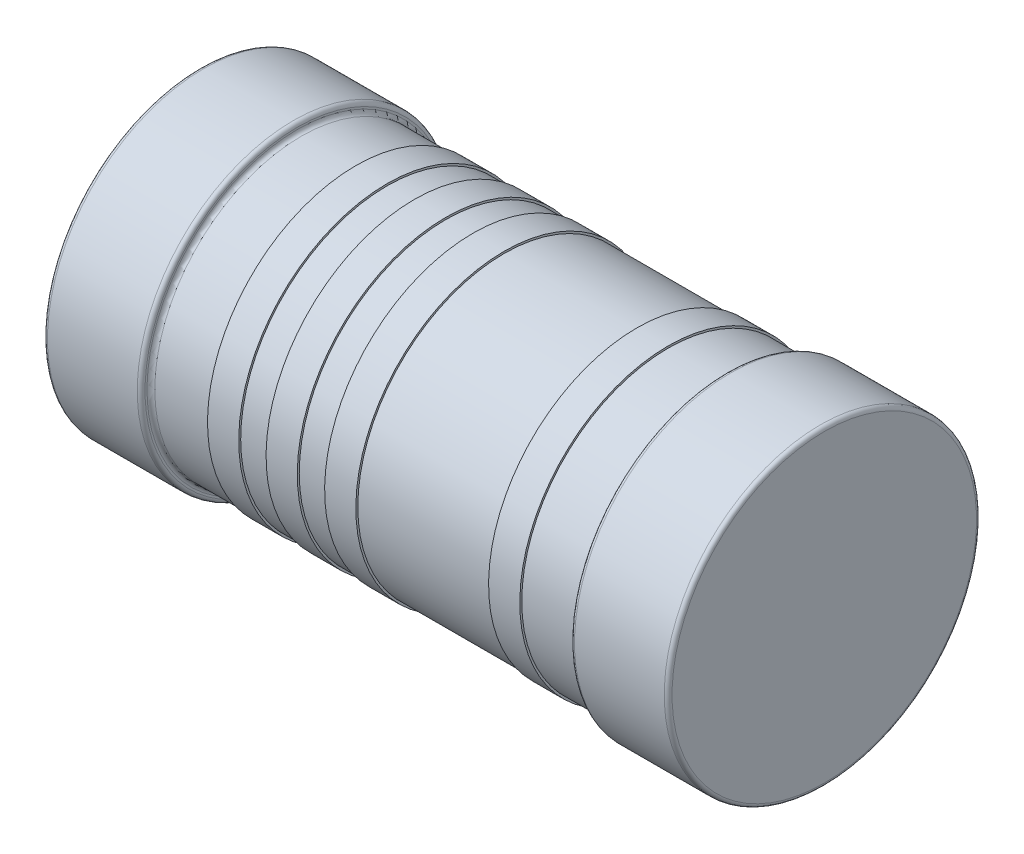
ISO-10303-21;
HEADER;
FILE_DESCRIPTION(('STEP AP214'),'2;1');
FILE_NAME('part.step','',(''),(''),'','','');
FILE_SCHEMA(('AUTOMOTIVE_DESIGN { 1 0 10303 214 1 1 1 1 }'));
ENDSEC;
DATA;
#1=APPLICATION_CONTEXT('core data for automotive mechanical design processes');
#2=APPLICATION_PROTOCOL_DEFINITION('international standard','automotive_design',2000,#1);
#3=PRODUCT_CONTEXT('',#1,'mechanical');
#4=PRODUCT('Part','Part','',(#3));
#5=PRODUCT_RELATED_PRODUCT_CATEGORY('part','',(#4));
#6=PRODUCT_DEFINITION_FORMATION('','',#4);
#7=PRODUCT_DEFINITION_CONTEXT('part definition',#1,'design');
#8=PRODUCT_DEFINITION('design','',#6,#7);
#9=PRODUCT_DEFINITION_SHAPE('','',#8);
#10=(LENGTH_UNIT() NAMED_UNIT(*) SI_UNIT(.MILLI.,.METRE.));
#11=(NAMED_UNIT(*) PLANE_ANGLE_UNIT() SI_UNIT($,.RADIAN.));
#12=(NAMED_UNIT(*) SI_UNIT($,.STERADIAN.) SOLID_ANGLE_UNIT());
#13=UNCERTAINTY_MEASURE_WITH_UNIT(LENGTH_MEASURE(1.E-05),#10,'distance_accuracy_value','');
#14=(GEOMETRIC_REPRESENTATION_CONTEXT(3) GLOBAL_UNCERTAINTY_ASSIGNED_CONTEXT((#13)) GLOBAL_UNIT_ASSIGNED_CONTEXT((#10,
#11,#12)) REPRESENTATION_CONTEXT('',''));
#15=CARTESIAN_POINT('',(0.,0.,0.));
#16=DIRECTION('',(0.,0.,1.));
#17=DIRECTION('',(1.,0.,0.));
#18=AXIS2_PLACEMENT_3D('',#15,#16,#17);
#19=CARTESIAN_POINT('',(-1.6,0.02,0.));
#20=DIRECTION('',(1.,0.,0.));
#21=DIRECTION('',(0.,1.,0.));
#22=AXIS2_PLACEMENT_3D('',#19,#20,#21);
#23=PLANE('',#22);
#24=CARTESIAN_POINT('',(-1.6,0.8,0.));
#25=DIRECTION('',(1.,0.,0.));
#26=DIRECTION('',(0.,1.,0.));
#27=AXIS2_PLACEMENT_3D('',#24,#25,#26);
#28=CIRCLE('',#27,0.78);
#29=CARTESIAN_POINT('',(-1.6,1.58,0.));
#30=VERTEX_POINT('',#29);
#31=EDGE_CURVE('E121',#30,#30,#28,.T.);
#32=ORIENTED_EDGE('',*,*,#31,.F.);
#33=EDGE_LOOP('',(#32));
#34=FACE_BOUND('',#33,.T.);
#35=ADVANCED_FACE('F33',(#34),#23,.F.);
#36=CARTESIAN_POINT('',(1.6,0.8,0.));
#37=DIRECTION('',(-1.,0.,0.));
#38=DIRECTION('',(0.,-1.,0.));
#39=AXIS2_PLACEMENT_3D('',#36,#37,#38);
#40=PLANE('',#39);
#41=CARTESIAN_POINT('',(1.6,0.8,0.));
#42=DIRECTION('',(1.,0.,0.));
#43=DIRECTION('',(0.,1.,0.));
#44=AXIS2_PLACEMENT_3D('',#41,#42,#43);
#45=CIRCLE('',#44,0.780000000000001);
#46=CARTESIAN_POINT('',(1.6,1.58,0.));
#47=VERTEX_POINT('',#46);
#48=EDGE_CURVE('E10',#47,#47,#45,.T.);
#49=ORIENTED_EDGE('',*,*,#48,.T.);
#50=EDGE_LOOP('',(#49));
#51=FACE_BOUND('',#50,.T.);
#52=ADVANCED_FACE('F128',(#51),#40,.F.);
#53=CARTESIAN_POINT('',(1.58,0.800000000000001,0.));
#54=DIRECTION('',(1.,0.,0.));
#55=DIRECTION('',(0.,1.,0.));
#56=AXIS2_PLACEMENT_3D('',#53,#54,#55);
#57=TOROIDAL_SURFACE('',#56,0.780000000000001,0.0200000000000002);
#58=ORIENTED_EDGE('',*,*,#48,.F.);
#59=EDGE_LOOP('',(#58));
#60=FACE_BOUND('',#59,.T.);
#61=CARTESIAN_POINT('',(1.58,0.8,0.));
#62=DIRECTION('',(1.,0.,0.));
#63=DIRECTION('',(0.,1.,0.));
#64=AXIS2_PLACEMENT_3D('',#61,#62,#63);
#65=CIRCLE('',#64,0.800000000000001);
#66=CARTESIAN_POINT('',(1.58,1.6,0.));
#67=VERTEX_POINT('',#66);
#68=EDGE_CURVE('E39',#67,#67,#65,.T.);
#69=ORIENTED_EDGE('',*,*,#68,.T.);
#70=EDGE_LOOP('',(#69));
#71=FACE_BOUND('',#70,.T.);
#72=ADVANCED_FACE('F132',(#60,#71),#57,.T.);
#73=CARTESIAN_POINT('',(-1.6,0.8,0.));
#74=DIRECTION('',(1.,0.,0.));
#75=DIRECTION('',(0.,1.,0.));
#76=AXIS2_PLACEMENT_3D('',#73,#74,#75);
#77=CYLINDRICAL_SURFACE('',#76,0.800000000000001);
#78=ORIENTED_EDGE('',*,*,#68,.F.);
#79=EDGE_LOOP('',(#78));
#80=FACE_BOUND('',#79,.T.);
#81=CARTESIAN_POINT('',(1.12,0.8,0.));
#82=DIRECTION('',(1.,0.,0.));
#83=DIRECTION('',(0.,1.,0.));
#84=AXIS2_PLACEMENT_3D('',#81,#82,#83);
#85=CIRCLE('',#84,0.8);
#86=CARTESIAN_POINT('',(1.12,1.6,0.));
#87=VERTEX_POINT('',#86);
#88=EDGE_CURVE('E43',#87,#87,#85,.T.);
#89=ORIENTED_EDGE('',*,*,#88,.T.);
#90=EDGE_LOOP('',(#89));
#91=FACE_BOUND('',#90,.T.);
#92=ADVANCED_FACE('F136',(#80,#91),#77,.T.);
#93=CARTESIAN_POINT('',(1.12,0.8,0.));
#94=DIRECTION('',(1.,0.,0.));
#95=DIRECTION('',(0.,1.,0.));
#96=AXIS2_PLACEMENT_3D('',#93,#94,#95);
#97=TOROIDAL_SURFACE('',#96,0.78,0.0200000000000001);
#98=ORIENTED_EDGE('',*,*,#88,.F.);
#99=EDGE_LOOP('',(#98));
#100=FACE_BOUND('',#99,.T.);
#101=CARTESIAN_POINT('',(1.1,0.8,0.));
#102=DIRECTION('',(1.,0.,0.));
#103=DIRECTION('',(0.,1.,0.));
#104=AXIS2_PLACEMENT_3D('',#101,#102,#103);
#105=CIRCLE('',#104,0.78);
#106=CARTESIAN_POINT('',(1.1,1.58,0.));
#107=VERTEX_POINT('',#106);
#108=EDGE_CURVE('E47',#107,#107,#105,.T.);
#109=ORIENTED_EDGE('',*,*,#108,.T.);
#110=EDGE_LOOP('',(#109));
#111=FACE_BOUND('',#110,.T.);
#112=ADVANCED_FACE('F142',(#100,#111),#97,.T.);
#113=CARTESIAN_POINT('',(1.1,0.03,0.));
#114=DIRECTION('',(1.,0.,0.));
#115=DIRECTION('',(0.,1.,0.));
#116=AXIS2_PLACEMENT_3D('',#113,#114,#115);
#117=PLANE('',#116);
#118=ORIENTED_EDGE('',*,*,#108,.F.);
#119=EDGE_LOOP('',(#118));
#120=FACE_BOUND('',#119,.T.);
#121=CARTESIAN_POINT('',(1.1,0.8,0.));
#122=DIRECTION('',(1.,0.,0.));
#123=DIRECTION('',(0.,1.,0.));
#124=AXIS2_PLACEMENT_3D('',#121,#122,#123);
#125=CIRCLE('',#124,0.77);
#126=CARTESIAN_POINT('',(1.1,1.57,0.));
#127=VERTEX_POINT('',#126);
#128=EDGE_CURVE('E52',#127,#127,#125,.T.);
#129=ORIENTED_EDGE('',*,*,#128,.T.);
#130=EDGE_LOOP('',(#129));
#131=FACE_BOUND('',#130,.T.);
#132=ADVANCED_FACE('F146',(#120,#131),#117,.F.);
#133=CARTESIAN_POINT('',(1.08,0.8,0.));
#134=DIRECTION('',(1.,0.,0.));
#135=DIRECTION('',(0.,1.,0.));
#136=AXIS2_PLACEMENT_3D('',#133,#134,#135);
#137=TOROIDAL_SURFACE('',#136,0.77,0.0199999999999999);
#138=ORIENTED_EDGE('',*,*,#128,.F.);
#139=EDGE_LOOP('',(#138));
#140=FACE_BOUND('',#139,.T.);
#141=CARTESIAN_POINT('',(1.08,0.8,0.));
#142=DIRECTION('',(1.,0.,0.));
#143=DIRECTION('',(0.,1.,0.));
#144=AXIS2_PLACEMENT_3D('',#141,#142,#143);
#145=CIRCLE('',#144,0.750000000000001);
#146=CARTESIAN_POINT('',(1.08,1.55,0.));
#147=VERTEX_POINT('',#146);
#148=EDGE_CURVE('E55',#147,#147,#145,.T.);
#149=ORIENTED_EDGE('',*,*,#148,.T.);
#150=EDGE_LOOP('',(#149));
#151=FACE_BOUND('',#150,.T.);
#152=ADVANCED_FACE('F150',(#140,#151),#137,.F.);
#153=CARTESIAN_POINT('',(-1.6,0.8,0.));
#154=DIRECTION('',(1.,0.,0.));
#155=DIRECTION('',(0.,1.,0.));
#156=AXIS2_PLACEMENT_3D('',#153,#154,#155);
#157=CYLINDRICAL_SURFACE('',#156,0.75);
#158=ORIENTED_EDGE('',*,*,#148,.F.);
#159=EDGE_LOOP('',(#158));
#160=FACE_BOUND('',#159,.T.);
#161=CARTESIAN_POINT('',(0.8,0.8,0.));
#162=DIRECTION('',(1.,0.,0.));
#163=DIRECTION('',(0.,1.,0.));
#164=AXIS2_PLACEMENT_3D('',#161,#162,#163);
#165=CIRCLE('',#164,0.75);
#166=CARTESIAN_POINT('',(0.8,1.55,0.));
#167=VERTEX_POINT('',#166);
#168=EDGE_CURVE('E58',#167,#167,#165,.T.);
#169=ORIENTED_EDGE('',*,*,#168,.T.);
#170=EDGE_LOOP('',(#169));
#171=FACE_BOUND('',#170,.T.);
#172=ADVANCED_FACE('F154',(#160,#171),#157,.T.);
#173=CARTESIAN_POINT('',(0.8,0.05,0.));
#174=DIRECTION('',(-1.,0.,0.));
#175=DIRECTION('',(0.,-1.,0.));
#176=AXIS2_PLACEMENT_3D('',#173,#174,#175);
#177=PLANE('',#176);
#178=ORIENTED_EDGE('',*,*,#168,.F.);
#179=EDGE_LOOP('',(#178));
#180=FACE_BOUND('',#179,.T.);
#181=CARTESIAN_POINT('',(0.8,0.8,0.));
#182=DIRECTION('',(1.,0.,0.));
#183=DIRECTION('',(0.,1.,0.));
#184=AXIS2_PLACEMENT_3D('',#181,#182,#183);
#185=CIRCLE('',#184,0.76);
#186=CARTESIAN_POINT('',(0.8,1.56,0.));
#187=VERTEX_POINT('',#186);
#188=EDGE_CURVE('E61',#187,#187,#185,.T.);
#189=ORIENTED_EDGE('',*,*,#188,.T.);
#190=EDGE_LOOP('',(#189));
#191=FACE_BOUND('',#190,.T.);
#192=ADVANCED_FACE('F158',(#180,#191),#177,.F.);
#193=CARTESIAN_POINT('',(-1.6,0.8,0.));
#194=DIRECTION('',(1.,0.,0.));
#195=DIRECTION('',(0.,1.,0.));
#196=AXIS2_PLACEMENT_3D('',#193,#194,#195);
#197=CYLINDRICAL_SURFACE('',#196,0.76);
#198=ORIENTED_EDGE('',*,*,#188,.F.);
#199=EDGE_LOOP('',(#198));
#200=FACE_BOUND('',#199,.T.);
#201=CARTESIAN_POINT('',(0.64,0.8,0.));
#202=DIRECTION('',(1.,0.,0.));
#203=DIRECTION('',(0.,1.,0.));
#204=AXIS2_PLACEMENT_3D('',#201,#202,#203);
#205=CIRCLE('',#204,0.76);
#206=CARTESIAN_POINT('',(0.64,1.56,0.));
#207=VERTEX_POINT('',#206);
#208=EDGE_CURVE('E64',#207,#207,#205,.T.);
#209=ORIENTED_EDGE('',*,*,#208,.T.);
#210=EDGE_LOOP('',(#209));
#211=FACE_BOUND('',#210,.T.);
#212=ADVANCED_FACE('F162',(#200,#211),#197,.T.);
#213=CARTESIAN_POINT('',(0.64,0.0400000000000001,0.));
#214=DIRECTION('',(1.,0.,0.));
#215=DIRECTION('',(0.,1.,0.));
#216=AXIS2_PLACEMENT_3D('',#213,#214,#215);
#217=PLANE('',#216);
#218=ORIENTED_EDGE('',*,*,#208,.F.);
#219=EDGE_LOOP('',(#218));
#220=FACE_BOUND('',#219,.T.);
#221=CARTESIAN_POINT('',(0.64,0.8,0.));
#222=DIRECTION('',(1.,0.,0.));
#223=DIRECTION('',(0.,1.,0.));
#224=AXIS2_PLACEMENT_3D('',#221,#222,#223);
#225=CIRCLE('',#224,0.75);
#226=CARTESIAN_POINT('',(0.64,1.55,0.));
#227=VERTEX_POINT('',#226);
#228=EDGE_CURVE('E67',#227,#227,#225,.T.);
#229=ORIENTED_EDGE('',*,*,#228,.T.);
#230=EDGE_LOOP('',(#229));
#231=FACE_BOUND('',#230,.T.);
#232=ADVANCED_FACE('F166',(#220,#231),#217,.F.);
#233=CARTESIAN_POINT('',(-1.6,0.8,0.));
#234=DIRECTION('',(1.,0.,0.));
#235=DIRECTION('',(0.,1.,0.));
#236=AXIS2_PLACEMENT_3D('',#233,#234,#235);
#237=CYLINDRICAL_SURFACE('',#236,0.75);
#238=ORIENTED_EDGE('',*,*,#228,.F.);
#239=EDGE_LOOP('',(#238));
#240=FACE_BOUND('',#239,.T.);
#241=CARTESIAN_POINT('',(-0.0400000000000003,0.8,0.));
#242=DIRECTION('',(1.,0.,0.));
#243=DIRECTION('',(0.,1.,0.));
#244=AXIS2_PLACEMENT_3D('',#241,#242,#243);
#245=CIRCLE('',#244,0.75);
#246=CARTESIAN_POINT('',(-0.0400000000000004,1.55,0.));
#247=VERTEX_POINT('',#246);
#248=EDGE_CURVE('E70',#247,#247,#245,.T.);
#249=ORIENTED_EDGE('',*,*,#248,.T.);
#250=EDGE_LOOP('',(#249));
#251=FACE_BOUND('',#250,.T.);
#252=ADVANCED_FACE('F170',(#240,#251),#237,.T.);
#253=CARTESIAN_POINT('',(-0.04,0.04,0.));
#254=DIRECTION('',(-1.,0.,0.));
#255=DIRECTION('',(0.,-1.,0.));
#256=AXIS2_PLACEMENT_3D('',#253,#254,#255);
#257=PLANE('',#256);
#258=ORIENTED_EDGE('',*,*,#248,.F.);
#259=EDGE_LOOP('',(#258));
#260=FACE_BOUND('',#259,.T.);
#261=CARTESIAN_POINT('',(-0.0400000000000001,0.8,0.));
#262=DIRECTION('',(1.,0.,0.));
#263=DIRECTION('',(0.,1.,0.));
#264=AXIS2_PLACEMENT_3D('',#261,#262,#263);
#265=CIRCLE('',#264,0.76);
#266=CARTESIAN_POINT('',(-0.0400000000000002,1.56,0.));
#267=VERTEX_POINT('',#266);
#268=EDGE_CURVE('E73',#267,#267,#265,.T.);
#269=ORIENTED_EDGE('',*,*,#268,.T.);
#270=EDGE_LOOP('',(#269));
#271=FACE_BOUND('',#270,.T.);
#272=ADVANCED_FACE('F174',(#260,#271),#257,.F.);
#273=CARTESIAN_POINT('',(-1.6,0.8,0.));
#274=DIRECTION('',(1.,0.,0.));
#275=DIRECTION('',(0.,1.,0.));
#276=AXIS2_PLACEMENT_3D('',#273,#274,#275);
#277=CYLINDRICAL_SURFACE('',#276,0.76);
#278=ORIENTED_EDGE('',*,*,#268,.F.);
#279=EDGE_LOOP('',(#278));
#280=FACE_BOUND('',#279,.T.);
#281=CARTESIAN_POINT('',(-0.2,0.8,0.));
#282=DIRECTION('',(1.,0.,0.));
#283=DIRECTION('',(0.,1.,0.));
#284=AXIS2_PLACEMENT_3D('',#281,#282,#283);
#285=CIRCLE('',#284,0.76);
#286=CARTESIAN_POINT('',(-0.2,1.56,0.));
#287=VERTEX_POINT('',#286);
#288=EDGE_CURVE('E76',#287,#287,#285,.T.);
#289=ORIENTED_EDGE('',*,*,#288,.T.);
#290=EDGE_LOOP('',(#289));
#291=FACE_BOUND('',#290,.T.);
#292=ADVANCED_FACE('F178',(#280,#291),#277,.T.);
#293=CARTESIAN_POINT('',(-0.2,0.04,0.));
#294=DIRECTION('',(1.,0.,0.));
#295=DIRECTION('',(0.,1.,0.));
#296=AXIS2_PLACEMENT_3D('',#293,#294,#295);
#297=PLANE('',#296);
#298=ORIENTED_EDGE('',*,*,#288,.F.);
#299=EDGE_LOOP('',(#298));
#300=FACE_BOUND('',#299,.T.);
#301=CARTESIAN_POINT('',(-0.2,0.8,0.));
#302=DIRECTION('',(1.,0.,0.));
#303=DIRECTION('',(0.,1.,0.));
#304=AXIS2_PLACEMENT_3D('',#301,#302,#303);
#305=CIRCLE('',#304,0.75);
#306=CARTESIAN_POINT('',(-0.2,1.55,0.));
#307=VERTEX_POINT('',#306);
#308=EDGE_CURVE('E79',#307,#307,#305,.T.);
#309=ORIENTED_EDGE('',*,*,#308,.T.);
#310=EDGE_LOOP('',(#309));
#311=FACE_BOUND('',#310,.T.);
#312=ADVANCED_FACE('F182',(#300,#311),#297,.F.);
#313=CARTESIAN_POINT('',(-1.6,0.8,0.));
#314=DIRECTION('',(1.,0.,0.));
#315=DIRECTION('',(0.,1.,0.));
#316=AXIS2_PLACEMENT_3D('',#313,#314,#315);
#317=CYLINDRICAL_SURFACE('',#316,0.75);
#318=ORIENTED_EDGE('',*,*,#308,.F.);
#319=EDGE_LOOP('',(#318));
#320=FACE_BOUND('',#319,.T.);
#321=CARTESIAN_POINT('',(-0.34,0.8,0.));
#322=DIRECTION('',(1.,0.,0.));
#323=DIRECTION('',(0.,1.,0.));
#324=AXIS2_PLACEMENT_3D('',#321,#322,#323);
#325=CIRCLE('',#324,0.75);
#326=CARTESIAN_POINT('',(-0.34,1.55,0.));
#327=VERTEX_POINT('',#326);
#328=EDGE_CURVE('E82',#327,#327,#325,.T.);
#329=ORIENTED_EDGE('',*,*,#328,.T.);
#330=EDGE_LOOP('',(#329));
#331=FACE_BOUND('',#330,.T.);
#332=ADVANCED_FACE('F186',(#320,#331),#317,.T.);
#333=CARTESIAN_POINT('',(-0.34,0.04,0.));
#334=DIRECTION('',(-1.,0.,0.));
#335=DIRECTION('',(0.,-1.,0.));
#336=AXIS2_PLACEMENT_3D('',#333,#334,#335);
#337=PLANE('',#336);
#338=ORIENTED_EDGE('',*,*,#328,.F.);
#339=EDGE_LOOP('',(#338));
#340=FACE_BOUND('',#339,.T.);
#341=CARTESIAN_POINT('',(-0.34,0.8,0.));
#342=DIRECTION('',(1.,0.,0.));
#343=DIRECTION('',(0.,1.,0.));
#344=AXIS2_PLACEMENT_3D('',#341,#342,#343);
#345=CIRCLE('',#344,0.76);
#346=CARTESIAN_POINT('',(-0.34,1.56,0.));
#347=VERTEX_POINT('',#346);
#348=EDGE_CURVE('E85',#347,#347,#345,.T.);
#349=ORIENTED_EDGE('',*,*,#348,.T.);
#350=EDGE_LOOP('',(#349));
#351=FACE_BOUND('',#350,.T.);
#352=ADVANCED_FACE('F190',(#340,#351),#337,.F.);
#353=CARTESIAN_POINT('',(-1.6,0.8,0.));
#354=DIRECTION('',(1.,0.,0.));
#355=DIRECTION('',(0.,1.,0.));
#356=AXIS2_PLACEMENT_3D('',#353,#354,#355);
#357=CYLINDRICAL_SURFACE('',#356,0.76);
#358=ORIENTED_EDGE('',*,*,#348,.F.);
#359=EDGE_LOOP('',(#358));
#360=FACE_BOUND('',#359,.T.);
#361=CARTESIAN_POINT('',(-0.5,0.8,0.));
#362=DIRECTION('',(1.,0.,0.));
#363=DIRECTION('',(0.,1.,0.));
#364=AXIS2_PLACEMENT_3D('',#361,#362,#363);
#365=CIRCLE('',#364,0.76);
#366=CARTESIAN_POINT('',(-0.5,1.56,0.));
#367=VERTEX_POINT('',#366);
#368=EDGE_CURVE('E88',#367,#367,#365,.T.);
#369=ORIENTED_EDGE('',*,*,#368,.T.);
#370=EDGE_LOOP('',(#369));
#371=FACE_BOUND('',#370,.T.);
#372=ADVANCED_FACE('F194',(#360,#371),#357,.T.);
#373=CARTESIAN_POINT('',(-0.5,0.05,0.));
#374=DIRECTION('',(1.,0.,0.));
#375=DIRECTION('',(0.,1.,0.));
#376=AXIS2_PLACEMENT_3D('',#373,#374,#375);
#377=PLANE('',#376);
#378=ORIENTED_EDGE('',*,*,#368,.F.);
#379=EDGE_LOOP('',(#378));
#380=FACE_BOUND('',#379,.T.);
#381=CARTESIAN_POINT('',(-0.5,0.8,0.));
#382=DIRECTION('',(1.,0.,0.));
#383=DIRECTION('',(0.,1.,0.));
#384=AXIS2_PLACEMENT_3D('',#381,#382,#383);
#385=CIRCLE('',#384,0.75);
#386=CARTESIAN_POINT('',(-0.5,1.55,0.));
#387=VERTEX_POINT('',#386);
#388=EDGE_CURVE('E91',#387,#387,#385,.T.);
#389=ORIENTED_EDGE('',*,*,#388,.T.);
#390=EDGE_LOOP('',(#389));
#391=FACE_BOUND('',#390,.T.);
#392=ADVANCED_FACE('F198',(#380,#391),#377,.F.);
#393=CARTESIAN_POINT('',(-1.6,0.8,0.));
#394=DIRECTION('',(1.,0.,0.));
#395=DIRECTION('',(0.,1.,0.));
#396=AXIS2_PLACEMENT_3D('',#393,#394,#395);
#397=CYLINDRICAL_SURFACE('',#396,0.75);
#398=ORIENTED_EDGE('',*,*,#388,.F.);
#399=EDGE_LOOP('',(#398));
#400=FACE_BOUND('',#399,.T.);
#401=CARTESIAN_POINT('',(-0.64,0.8,0.));
#402=DIRECTION('',(1.,0.,0.));
#403=DIRECTION('',(0.,1.,0.));
#404=AXIS2_PLACEMENT_3D('',#401,#402,#403);
#405=CIRCLE('',#404,0.75);
#406=CARTESIAN_POINT('',(-0.64,1.55,0.));
#407=VERTEX_POINT('',#406);
#408=EDGE_CURVE('E94',#407,#407,#405,.T.);
#409=ORIENTED_EDGE('',*,*,#408,.T.);
#410=EDGE_LOOP('',(#409));
#411=FACE_BOUND('',#410,.T.);
#412=ADVANCED_FACE('F202',(#400,#411),#397,.T.);
#413=CARTESIAN_POINT('',(-0.64,0.04,0.));
#414=DIRECTION('',(-1.,0.,0.));
#415=DIRECTION('',(0.,-1.,0.));
#416=AXIS2_PLACEMENT_3D('',#413,#414,#415);
#417=PLANE('',#416);
#418=ORIENTED_EDGE('',*,*,#408,.F.);
#419=EDGE_LOOP('',(#418));
#420=FACE_BOUND('',#419,.T.);
#421=CARTESIAN_POINT('',(-0.64,0.8,0.));
#422=DIRECTION('',(1.,0.,0.));
#423=DIRECTION('',(0.,1.,0.));
#424=AXIS2_PLACEMENT_3D('',#421,#422,#423);
#425=CIRCLE('',#424,0.76);
#426=CARTESIAN_POINT('',(-0.64,1.56,0.));
#427=VERTEX_POINT('',#426);
#428=EDGE_CURVE('E97',#427,#427,#425,.T.);
#429=ORIENTED_EDGE('',*,*,#428,.T.);
#430=EDGE_LOOP('',(#429));
#431=FACE_BOUND('',#430,.T.);
#432=ADVANCED_FACE('F206',(#420,#431),#417,.F.);
#433=CARTESIAN_POINT('',(-1.6,0.8,0.));
#434=DIRECTION('',(1.,0.,0.));
#435=DIRECTION('',(0.,1.,0.));
#436=AXIS2_PLACEMENT_3D('',#433,#434,#435);
#437=CYLINDRICAL_SURFACE('',#436,0.76);
#438=ORIENTED_EDGE('',*,*,#428,.F.);
#439=EDGE_LOOP('',(#438));
#440=FACE_BOUND('',#439,.T.);
#441=CARTESIAN_POINT('',(-0.8,0.8,0.));
#442=DIRECTION('',(1.,0.,0.));
#443=DIRECTION('',(0.,1.,0.));
#444=AXIS2_PLACEMENT_3D('',#441,#442,#443);
#445=CIRCLE('',#444,0.76);
#446=CARTESIAN_POINT('',(-0.8,1.56,0.));
#447=VERTEX_POINT('',#446);
#448=EDGE_CURVE('E100',#447,#447,#445,.T.);
#449=ORIENTED_EDGE('',*,*,#448,.T.);
#450=EDGE_LOOP('',(#449));
#451=FACE_BOUND('',#450,.T.);
#452=ADVANCED_FACE('F210',(#440,#451),#437,.T.);
#453=CARTESIAN_POINT('',(-0.8,0.05,0.));
#454=DIRECTION('',(1.,0.,0.));
#455=DIRECTION('',(0.,1.,0.));
#456=AXIS2_PLACEMENT_3D('',#453,#454,#455);
#457=PLANE('',#456);
#458=ORIENTED_EDGE('',*,*,#448,.F.);
#459=EDGE_LOOP('',(#458));
#460=FACE_BOUND('',#459,.T.);
#461=CARTESIAN_POINT('',(-0.8,0.8,0.));
#462=DIRECTION('',(1.,0.,0.));
#463=DIRECTION('',(0.,1.,0.));
#464=AXIS2_PLACEMENT_3D('',#461,#462,#463);
#465=CIRCLE('',#464,0.75);
#466=CARTESIAN_POINT('',(-0.8,1.55,0.));
#467=VERTEX_POINT('',#466);
#468=EDGE_CURVE('E103',#467,#467,#465,.T.);
#469=ORIENTED_EDGE('',*,*,#468,.T.);
#470=EDGE_LOOP('',(#469));
#471=FACE_BOUND('',#470,.T.);
#472=ADVANCED_FACE('F214',(#460,#471),#457,.F.);
#473=CARTESIAN_POINT('',(-1.6,0.8,0.));
#474=DIRECTION('',(1.,0.,0.));
#475=DIRECTION('',(0.,1.,0.));
#476=AXIS2_PLACEMENT_3D('',#473,#474,#475);
#477=CYLINDRICAL_SURFACE('',#476,0.75);
#478=ORIENTED_EDGE('',*,*,#468,.F.);
#479=EDGE_LOOP('',(#478));
#480=FACE_BOUND('',#479,.T.);
#481=CARTESIAN_POINT('',(-1.08,0.8,0.));
#482=DIRECTION('',(1.,0.,0.));
#483=DIRECTION('',(0.,1.,0.));
#484=AXIS2_PLACEMENT_3D('',#481,#482,#483);
#485=CIRCLE('',#484,0.75);
#486=CARTESIAN_POINT('',(-1.08,1.55,0.));
#487=VERTEX_POINT('',#486);
#488=EDGE_CURVE('E106',#487,#487,#485,.T.);
#489=ORIENTED_EDGE('',*,*,#488,.T.);
#490=EDGE_LOOP('',(#489));
#491=FACE_BOUND('',#490,.T.);
#492=ADVANCED_FACE('F218',(#480,#491),#477,.T.);
#493=CARTESIAN_POINT('',(-1.08,0.8,0.));
#494=DIRECTION('',(1.,0.,0.));
#495=DIRECTION('',(0.,1.,0.));
#496=AXIS2_PLACEMENT_3D('',#493,#494,#495);
#497=TOROIDAL_SURFACE('',#496,0.77,0.0199999999999999);
#498=ORIENTED_EDGE('',*,*,#488,.F.);
#499=EDGE_LOOP('',(#498));
#500=FACE_BOUND('',#499,.T.);
#501=CARTESIAN_POINT('',(-1.1,0.8,0.));
#502=DIRECTION('',(1.,0.,0.));
#503=DIRECTION('',(0.,1.,0.));
#504=AXIS2_PLACEMENT_3D('',#501,#502,#503);
#505=CIRCLE('',#504,0.77);
#506=CARTESIAN_POINT('',(-1.1,1.57,0.));
#507=VERTEX_POINT('',#506);
#508=EDGE_CURVE('E109',#507,#507,#505,.T.);
#509=ORIENTED_EDGE('',*,*,#508,.T.);
#510=EDGE_LOOP('',(#509));
#511=FACE_BOUND('',#510,.T.);
#512=ADVANCED_FACE('F222',(#500,#511),#497,.F.);
#513=CARTESIAN_POINT('',(-1.1,0.02,0.));
#514=DIRECTION('',(-1.,0.,0.));
#515=DIRECTION('',(0.,-1.,0.));
#516=AXIS2_PLACEMENT_3D('',#513,#514,#515);
#517=PLANE('',#516);
#518=ORIENTED_EDGE('',*,*,#508,.F.);
#519=EDGE_LOOP('',(#518));
#520=FACE_BOUND('',#519,.T.);
#521=CARTESIAN_POINT('',(-1.1,0.8,0.));
#522=DIRECTION('',(1.,0.,0.));
#523=DIRECTION('',(0.,1.,0.));
#524=AXIS2_PLACEMENT_3D('',#521,#522,#523);
#525=CIRCLE('',#524,0.78);
#526=CARTESIAN_POINT('',(-1.1,1.58,0.));
#527=VERTEX_POINT('',#526);
#528=EDGE_CURVE('E112',#527,#527,#525,.T.);
#529=ORIENTED_EDGE('',*,*,#528,.T.);
#530=EDGE_LOOP('',(#529));
#531=FACE_BOUND('',#530,.T.);
#532=ADVANCED_FACE('F226',(#520,#531),#517,.F.);
#533=CARTESIAN_POINT('',(-1.12,0.8,0.));
#534=DIRECTION('',(1.,0.,0.));
#535=DIRECTION('',(0.,1.,0.));
#536=AXIS2_PLACEMENT_3D('',#533,#534,#535);
#537=TOROIDAL_SURFACE('',#536,0.78,0.0200000000000001);
#538=ORIENTED_EDGE('',*,*,#528,.F.);
#539=EDGE_LOOP('',(#538));
#540=FACE_BOUND('',#539,.T.);
#541=CARTESIAN_POINT('',(-1.12,0.8,0.));
#542=DIRECTION('',(1.,0.,0.));
#543=DIRECTION('',(0.,1.,0.));
#544=AXIS2_PLACEMENT_3D('',#541,#542,#543);
#545=CIRCLE('',#544,0.8);
#546=CARTESIAN_POINT('',(-1.12,1.6,0.));
#547=VERTEX_POINT('',#546);
#548=EDGE_CURVE('E115',#547,#547,#545,.T.);
#549=ORIENTED_EDGE('',*,*,#548,.T.);
#550=EDGE_LOOP('',(#549));
#551=FACE_BOUND('',#550,.T.);
#552=ADVANCED_FACE('F230',(#540,#551),#537,.T.);
#553=CARTESIAN_POINT('',(-1.6,0.8,0.));
#554=DIRECTION('',(1.,0.,0.));
#555=DIRECTION('',(0.,1.,0.));
#556=AXIS2_PLACEMENT_3D('',#553,#554,#555);
#557=CYLINDRICAL_SURFACE('',#556,0.8);
#558=ORIENTED_EDGE('',*,*,#548,.F.);
#559=EDGE_LOOP('',(#558));
#560=FACE_BOUND('',#559,.T.);
#561=CARTESIAN_POINT('',(-1.58,0.8,0.));
#562=DIRECTION('',(1.,0.,0.));
#563=DIRECTION('',(0.,1.,0.));
#564=AXIS2_PLACEMENT_3D('',#561,#562,#563);
#565=CIRCLE('',#564,0.8);
#566=CARTESIAN_POINT('',(-1.58,1.6,0.));
#567=VERTEX_POINT('',#566);
#568=EDGE_CURVE('E118',#567,#567,#565,.T.);
#569=ORIENTED_EDGE('',*,*,#568,.T.);
#570=EDGE_LOOP('',(#569));
#571=FACE_BOUND('',#570,.T.);
#572=ADVANCED_FACE('F234',(#560,#571),#557,.T.);
#573=CARTESIAN_POINT('',(-1.58,0.8,0.));
#574=DIRECTION('',(1.,0.,0.));
#575=DIRECTION('',(0.,1.,0.));
#576=AXIS2_PLACEMENT_3D('',#573,#574,#575);
#577=TOROIDAL_SURFACE('',#576,0.78,0.0200000000000002);
#578=ORIENTED_EDGE('',*,*,#568,.F.);
#579=EDGE_LOOP('',(#578));
#580=FACE_BOUND('',#579,.T.);
#581=ORIENTED_EDGE('',*,*,#31,.T.);
#582=EDGE_LOOP('',(#581));
#583=FACE_BOUND('',#582,.T.);
#584=ADVANCED_FACE('F125',(#580,#583),#577,.T.);
#585=CLOSED_SHELL('',(#35,#52,#72,#92,#112,#132,#152,#172,#192,#212,#232,#252,#272,#292,#312,
#332,#352,#372,#392,#412,#432,#452,#472,#492,#512,#532,#552,#572,#584));
#586=MANIFOLD_SOLID_BREP('B2',#585);
#587=ADVANCED_BREP_SHAPE_REPRESENTATION('',(#18,#586),#14);
#588=SHAPE_DEFINITION_REPRESENTATION(#9,#587);
ENDSEC;
END-ISO-10303-21;
